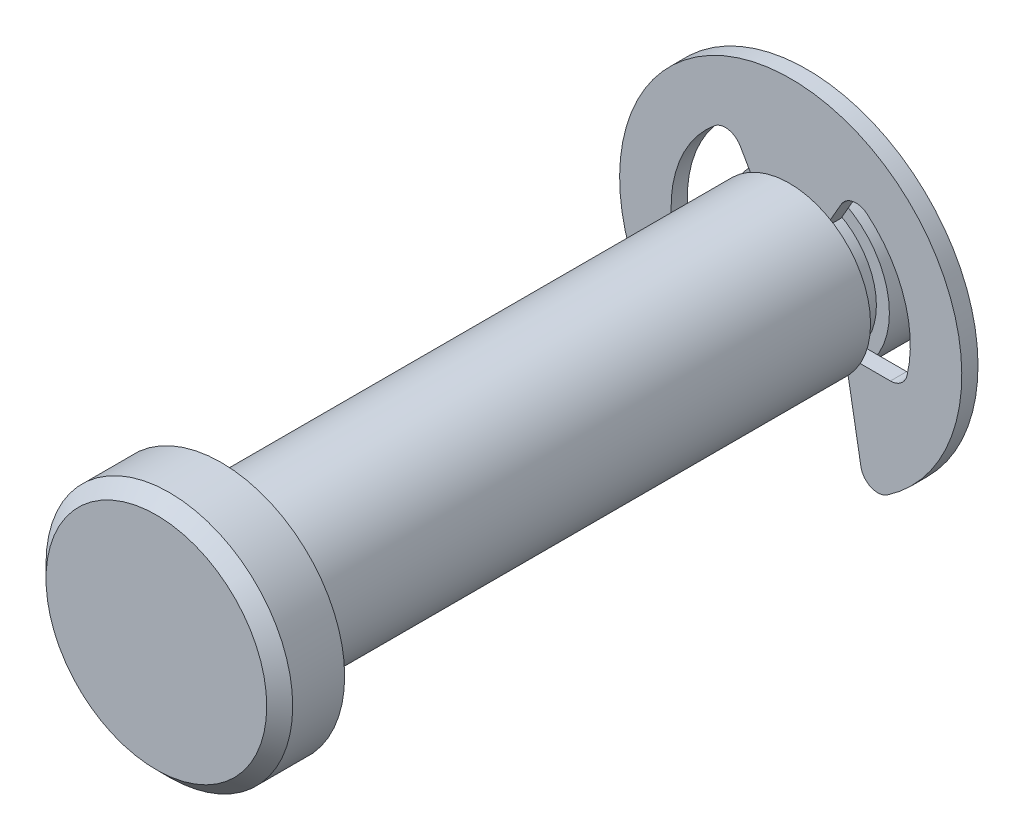
ISO-10303-21;
HEADER;
FILE_DESCRIPTION(('STEP AP214'),'2;1');
FILE_NAME('part.step','',(''),(''),'','','');
FILE_SCHEMA(('AUTOMOTIVE_DESIGN { 1 0 10303 214 1 1 1 1 }'));
ENDSEC;
DATA;
#1=APPLICATION_CONTEXT('core data for automotive mechanical design processes');
#2=APPLICATION_PROTOCOL_DEFINITION('international standard','automotive_design',2000,#1);
#3=PRODUCT_CONTEXT('',#1,'mechanical');
#4=PRODUCT('Part','Part','',(#3));
#5=PRODUCT_RELATED_PRODUCT_CATEGORY('part','',(#4));
#6=PRODUCT_DEFINITION_FORMATION('','',#4);
#7=PRODUCT_DEFINITION_CONTEXT('part definition',#1,'design');
#8=PRODUCT_DEFINITION('design','',#6,#7);
#9=PRODUCT_DEFINITION_SHAPE('','',#8);
#10=(LENGTH_UNIT() NAMED_UNIT(*) SI_UNIT(.MILLI.,.METRE.));
#11=(NAMED_UNIT(*) PLANE_ANGLE_UNIT() SI_UNIT($,.RADIAN.));
#12=(NAMED_UNIT(*) SI_UNIT($,.STERADIAN.) SOLID_ANGLE_UNIT());
#13=UNCERTAINTY_MEASURE_WITH_UNIT(LENGTH_MEASURE(1.E-05),#10,'distance_accuracy_value','');
#14=(GEOMETRIC_REPRESENTATION_CONTEXT(3) GLOBAL_UNCERTAINTY_ASSIGNED_CONTEXT((#13)) GLOBAL_UNIT_ASSIGNED_CONTEXT((#10,
#11,#12)) REPRESENTATION_CONTEXT('',''));
#15=CARTESIAN_POINT('',(0.,0.,0.));
#16=DIRECTION('',(0.,0.,1.));
#17=DIRECTION('',(1.,0.,0.));
#18=AXIS2_PLACEMENT_3D('',#15,#16,#17);
#19=CARTESIAN_POINT('',(0.,0.,-9.5758));
#20=DIRECTION('',(0.,0.,1.));
#21=DIRECTION('',(1.,0.,0.));
#22=AXIS2_PLACEMENT_3D('',#19,#20,#21);
#23=PLANE('',#22);
#24=DIRECTION('',(-0.173648177666931,0.984807753012208,0.));
#25=VECTOR('',#24,1.);
#26=CARTESIAN_POINT('',(1.79561377117954,0.316615154790629,-9.5758));
#27=LINE('',#26,#25);
#28=CARTESIAN_POINT('',(2.74784570227755,-5.08376048410501,-9.5758));
#29=VERTEX_POINT('',#28);
#30=CARTESIAN_POINT('',(2.1336,-1.6002,-9.5758));
#31=VERTEX_POINT('',#30);
#32=EDGE_CURVE('E201',#29,#31,#27,.T.);
#33=ORIENTED_EDGE('',*,*,#32,.F.);
#34=CARTESIAN_POINT('',(3.4069676832911,-4.96753949527431,-9.5758));
#35=DIRECTION('',(0.,0.,1.));
#36=DIRECTION('',(1.,0.,0.));
#37=AXIS2_PLACEMENT_3D('',#34,#35,#36);
#38=CIRCLE('',#37,0.66929);
#39=CARTESIAN_POINT('',(3.78551964810122,-5.51948832808256,-9.5758));
#40=VERTEX_POINT('',#39);
#41=EDGE_CURVE('E255',#29,#40,#38,.T.);
#42=ORIENTED_EDGE('',*,*,#41,.T.);
#43=CARTESIAN_POINT('',(0.,0.,-9.5758));
#44=DIRECTION('',(0.,0.,1.));
#45=DIRECTION('',(1.,0.,0.));
#46=AXIS2_PLACEMENT_3D('',#43,#44,#45);
#47=CIRCLE('',#46,6.6929);
#48=CARTESIAN_POINT('',(-3.78551964810122,-5.51948832808256,-9.5758));
#49=VERTEX_POINT('',#48);
#50=EDGE_CURVE('E181',#40,#49,#47,.T.);
#51=ORIENTED_EDGE('',*,*,#50,.T.);
#52=CARTESIAN_POINT('',(-3.4069676832911,-4.96753949527431,-9.5758));
#53=DIRECTION('',(0.,0.,1.));
#54=DIRECTION('',(1.,0.,0.));
#55=AXIS2_PLACEMENT_3D('',#52,#53,#54);
#56=CIRCLE('',#55,0.66929);
#57=CARTESIAN_POINT('',(-2.74784570227755,-5.08376048410501,-9.5758));
#58=VERTEX_POINT('',#57);
#59=EDGE_CURVE('E253',#49,#58,#56,.T.);
#60=ORIENTED_EDGE('',*,*,#59,.T.);
#61=DIRECTION('',(-0.173648177666931,-0.984807753012208,0.));
#62=VECTOR('',#61,1.);
#63=CARTESIAN_POINT('',(-1.79561377117954,0.316615154790629,-9.5758));
#64=LINE('',#63,#62);
#65=CARTESIAN_POINT('',(-2.1336,-1.6002,-9.5758));
#66=VERTEX_POINT('',#65);
#67=EDGE_CURVE('E197',#66,#58,#64,.T.);
#68=ORIENTED_EDGE('',*,*,#67,.F.);
#69=DIRECTION('',(1.,0.,0.));
#70=VECTOR('',#69,1.);
#71=CARTESIAN_POINT('',(0.,-1.6002,-9.5758));
#72=LINE('',#71,#70);
#73=CARTESIAN_POINT('',(-3.90112806858478,-1.6002,-9.5758));
#74=VERTEX_POINT('',#73);
#75=EDGE_CURVE('E188',#74,#66,#72,.T.);
#76=ORIENTED_EDGE('',*,*,#75,.F.);
#77=CARTESIAN_POINT('',(-3.90112806858478,-0.93091,-9.5758));
#78=DIRECTION('',(0.,0.,1.));
#79=DIRECTION('',(1.,0.,0.));
#80=AXIS2_PLACEMENT_3D('',#77,#78,#79);
#81=CIRCLE('',#80,0.66929);
#82=CARTESIAN_POINT('',(-4.55213962404525,-1.08625818556048,-9.5758));
#83=VERTEX_POINT('',#82);
#84=EDGE_CURVE('E53',#74,#83,#81,.F.);
#85=ORIENTED_EDGE('',*,*,#84,.T.);
#86=CARTESIAN_POINT('',(0.,0.,-9.5758));
#87=DIRECTION('',(0.,0.,1.));
#88=DIRECTION('',(1.,0.,0.));
#89=AXIS2_PLACEMENT_3D('',#86,#87,#88);
#90=CIRCLE('',#89,4.67995);
#91=CARTESIAN_POINT('',(-2.98351110662977,3.60563357527034,-9.5758));
#92=VERTEX_POINT('',#91);
#93=EDGE_CURVE('E213',#92,#83,#90,.T.);
#94=ORIENTED_EDGE('',*,*,#93,.F.);
#95=CARTESIAN_POINT('',(-2.55683258473184,3.08998394320319,-9.5758));
#96=DIRECTION('',(0.,0.,1.));
#97=DIRECTION('',(1.,0.,0.));
#98=AXIS2_PLACEMENT_3D('',#95,#96,#97);
#99=CIRCLE('',#98,0.66929);
#100=CARTESIAN_POINT('',(-1.97721044223295,3.42462894320319,-9.5758));
#101=VERTEX_POINT('',#100);
#102=EDGE_CURVE('E185',#92,#101,#99,.F.);
#103=ORIENTED_EDGE('',*,*,#102,.T.);
#104=DIRECTION('',(-0.500000000000001,0.866025403784438,0.));
#105=VECTOR('',#104,1.);
#106=CARTESIAN_POINT('',(0.,0.,-9.5758));
#107=LINE('',#106,#105);
#108=CARTESIAN_POINT('',(-1.3335,2.30968975189309,-9.5758));
#109=VERTEX_POINT('',#108);
#110=EDGE_CURVE('E177',#109,#101,#107,.T.);
#111=ORIENTED_EDGE('',*,*,#110,.F.);
#112=DIRECTION('',(1.,0.,0.));
#113=VECTOR('',#112,1.);
#114=CARTESIAN_POINT('',(-1.3335,2.30968975189309,-9.5758));
#115=LINE('',#114,#113);
#116=CARTESIAN_POINT('',(1.3335,2.30968975189309,-9.5758));
#117=VERTEX_POINT('',#116);
#118=EDGE_CURVE('E161',#109,#117,#115,.T.);
#119=ORIENTED_EDGE('',*,*,#118,.T.);
#120=DIRECTION('',(-0.500000000000001,-0.866025403784438,0.));
#121=VECTOR('',#120,1.);
#122=CARTESIAN_POINT('',(0.,0.,-9.5758));
#123=LINE('',#122,#121);
#124=CARTESIAN_POINT('',(1.97721044223295,3.42462894320319,-9.5758));
#125=VERTEX_POINT('',#124);
#126=EDGE_CURVE('E211',#125,#117,#123,.T.);
#127=ORIENTED_EDGE('',*,*,#126,.F.);
#128=CARTESIAN_POINT('',(2.55683258473184,3.08998394320319,-9.5758));
#129=DIRECTION('',(0.,0.,1.));
#130=DIRECTION('',(1.,0.,0.));
#131=AXIS2_PLACEMENT_3D('',#128,#129,#130);
#132=CIRCLE('',#131,0.66929);
#133=CARTESIAN_POINT('',(2.98351110662977,3.60563357527034,-9.5758));
#134=VERTEX_POINT('',#133);
#135=EDGE_CURVE('E270',#125,#134,#132,.F.);
#136=ORIENTED_EDGE('',*,*,#135,.T.);
#137=CARTESIAN_POINT('',(0.,0.,-9.5758));
#138=DIRECTION('',(0.,0.,1.));
#139=DIRECTION('',(1.,0.,0.));
#140=AXIS2_PLACEMENT_3D('',#137,#138,#139);
#141=CIRCLE('',#140,4.67995);
#142=CARTESIAN_POINT('',(4.55213962404525,-1.08625818556048,-9.5758));
#143=VERTEX_POINT('',#142);
#144=EDGE_CURVE('E216',#143,#134,#141,.T.);
#145=ORIENTED_EDGE('',*,*,#144,.F.);
#146=CARTESIAN_POINT('',(3.90112806858478,-0.93091,-9.5758));
#147=DIRECTION('',(0.,0.,1.));
#148=DIRECTION('',(1.,0.,0.));
#149=AXIS2_PLACEMENT_3D('',#146,#147,#148);
#150=CIRCLE('',#149,0.66929);
#151=CARTESIAN_POINT('',(3.90112806858478,-1.6002,-9.5758));
#152=VERTEX_POINT('',#151);
#153=EDGE_CURVE('E266',#143,#152,#150,.F.);
#154=ORIENTED_EDGE('',*,*,#153,.T.);
#155=DIRECTION('',(1.,0.,0.));
#156=VECTOR('',#155,1.);
#157=CARTESIAN_POINT('',(0.,-1.6002,-9.5758));
#158=LINE('',#157,#156);
#159=EDGE_CURVE('E206',#31,#152,#158,.T.);
#160=ORIENTED_EDGE('',*,*,#159,.F.);
#161=EDGE_LOOP('',(#33,#42,#51,#60,#68,#76,#85,#94,#103,#111,#119,#127,#136,#145,#154,#160));
#162=FACE_BOUND('',#161,.T.);
#163=ADVANCED_FACE('F45',(#162),#23,.T.);
#164=CARTESIAN_POINT('',(0.,0.,-10.2108));
#165=DIRECTION('',(0.,0.,1.));
#166=DIRECTION('',(1.,0.,0.));
#167=AXIS2_PLACEMENT_3D('',#164,#165,#166);
#168=PLANE('',#167);
#169=CARTESIAN_POINT('',(0.,0.,-10.2108));
#170=DIRECTION('',(0.,0.,1.));
#171=DIRECTION('',(1.,0.,0.));
#172=AXIS2_PLACEMENT_3D('',#169,#170,#171);
#173=CIRCLE('',#172,6.6929);
#174=CARTESIAN_POINT('',(3.78551964810122,-5.51948832808256,-10.2108));
#175=VERTEX_POINT('',#174);
#176=CARTESIAN_POINT('',(-3.78551964810122,-5.51948832808256,-10.2108));
#177=VERTEX_POINT('',#176);
#178=EDGE_CURVE('E219',#175,#177,#173,.T.);
#179=ORIENTED_EDGE('',*,*,#178,.F.);
#180=CARTESIAN_POINT('',(3.4069676832911,-4.96753949527431,-10.2108));
#181=DIRECTION('',(0.,0.,1.));
#182=DIRECTION('',(1.,0.,0.));
#183=AXIS2_PLACEMENT_3D('',#180,#181,#182);
#184=CIRCLE('',#183,0.66929);
#185=CARTESIAN_POINT('',(2.74784570227755,-5.08376048410501,-10.2108));
#186=VERTEX_POINT('',#185);
#187=EDGE_CURVE('E263',#175,#186,#184,.F.);
#188=ORIENTED_EDGE('',*,*,#187,.T.);
#189=DIRECTION('',(-0.173648177666931,0.984807753012208,0.));
#190=VECTOR('',#189,1.);
#191=CARTESIAN_POINT('',(1.79561377117954,0.316615154790629,-10.2108));
#192=LINE('',#191,#190);
#193=CARTESIAN_POINT('',(2.1336,-1.6002,-10.2108));
#194=VERTEX_POINT('',#193);
#195=EDGE_CURVE('E199',#186,#194,#192,.T.);
#196=ORIENTED_EDGE('',*,*,#195,.T.);
#197=DIRECTION('',(1.,0.,0.));
#198=VECTOR('',#197,1.);
#199=CARTESIAN_POINT('',(0.,-1.6002,-10.2108));
#200=LINE('',#199,#198);
#201=CARTESIAN_POINT('',(3.90112806858478,-1.6002,-10.2108));
#202=VERTEX_POINT('',#201);
#203=EDGE_CURVE('E203',#194,#202,#200,.T.);
#204=ORIENTED_EDGE('',*,*,#203,.T.);
#205=CARTESIAN_POINT('',(3.90112806858478,-0.93091,-10.2108));
#206=DIRECTION('',(0.,0.,1.));
#207=DIRECTION('',(1.,0.,0.));
#208=AXIS2_PLACEMENT_3D('',#205,#206,#207);
#209=CIRCLE('',#208,0.66929);
#210=CARTESIAN_POINT('',(4.55213962404525,-1.08625818556048,-10.2108));
#211=VERTEX_POINT('',#210);
#212=EDGE_CURVE('E268',#202,#211,#209,.T.);
#213=ORIENTED_EDGE('',*,*,#212,.T.);
#214=CARTESIAN_POINT('',(0.,0.,-10.2108));
#215=DIRECTION('',(0.,0.,1.));
#216=DIRECTION('',(1.,0.,0.));
#217=AXIS2_PLACEMENT_3D('',#214,#215,#216);
#218=CIRCLE('',#217,4.67995);
#219=CARTESIAN_POINT('',(2.98351110662977,3.60563357527034,-10.2108));
#220=VERTEX_POINT('',#219);
#221=EDGE_CURVE('E227',#211,#220,#218,.T.);
#222=ORIENTED_EDGE('',*,*,#221,.T.);
#223=CARTESIAN_POINT('',(2.55683258473184,3.08998394320319,-10.2108));
#224=DIRECTION('',(0.,0.,1.));
#225=DIRECTION('',(1.,0.,0.));
#226=AXIS2_PLACEMENT_3D('',#223,#224,#225);
#227=CIRCLE('',#226,0.66929);
#228=CARTESIAN_POINT('',(1.97721044223295,3.42462894320319,-10.2108));
#229=VERTEX_POINT('',#228);
#230=EDGE_CURVE('E272',#220,#229,#227,.T.);
#231=ORIENTED_EDGE('',*,*,#230,.T.);
#232=DIRECTION('',(-0.500000000000001,-0.866025403784438,0.));
#233=VECTOR('',#232,1.);
#234=CARTESIAN_POINT('',(0.,0.,-10.2108));
#235=LINE('',#234,#233);
#236=CARTESIAN_POINT('',(1.3335,2.30968975189309,-10.2108));
#237=VERTEX_POINT('',#236);
#238=EDGE_CURVE('E209',#229,#237,#235,.T.);
#239=ORIENTED_EDGE('',*,*,#238,.T.);
#240=DIRECTION('',(-1.,0.,0.));
#241=VECTOR('',#240,1.);
#242=CARTESIAN_POINT('',(-1.3335,2.30968975189309,-10.2108));
#243=LINE('',#242,#241);
#244=CARTESIAN_POINT('',(-1.3335,2.30968975189309,-10.2108));
#245=VERTEX_POINT('',#244);
#246=EDGE_CURVE('E172',#237,#245,#243,.T.);
#247=ORIENTED_EDGE('',*,*,#246,.T.);
#248=DIRECTION('',(-0.500000000000001,0.866025403784438,0.));
#249=VECTOR('',#248,1.);
#250=CARTESIAN_POINT('',(0.,0.,-10.2108));
#251=LINE('',#250,#249);
#252=CARTESIAN_POINT('',(-1.97721044223295,3.42462894320319,-10.2108));
#253=VERTEX_POINT('',#252);
#254=EDGE_CURVE('E180',#245,#253,#251,.T.);
#255=ORIENTED_EDGE('',*,*,#254,.T.);
#256=CARTESIAN_POINT('',(-2.55683258473184,3.08998394320319,-10.2108));
#257=DIRECTION('',(0.,0.,1.));
#258=DIRECTION('',(1.,0.,0.));
#259=AXIS2_PLACEMENT_3D('',#256,#257,#258);
#260=CIRCLE('',#259,0.66929);
#261=CARTESIAN_POINT('',(-2.98351110662977,3.60563357527034,-10.2108));
#262=VERTEX_POINT('',#261);
#263=EDGE_CURVE('E275',#253,#262,#260,.T.);
#264=ORIENTED_EDGE('',*,*,#263,.T.);
#265=CARTESIAN_POINT('',(0.,0.,-10.2108));
#266=DIRECTION('',(0.,0.,1.));
#267=DIRECTION('',(1.,0.,0.));
#268=AXIS2_PLACEMENT_3D('',#265,#266,#267);
#269=CIRCLE('',#268,4.67995);
#270=CARTESIAN_POINT('',(-4.55213962404525,-1.08625818556048,-10.2108));
#271=VERTEX_POINT('',#270);
#272=EDGE_CURVE('E224',#262,#271,#269,.T.);
#273=ORIENTED_EDGE('',*,*,#272,.T.);
#274=CARTESIAN_POINT('',(-3.90112806858478,-0.93091,-10.2108));
#275=DIRECTION('',(0.,0.,1.));
#276=DIRECTION('',(1.,0.,0.));
#277=AXIS2_PLACEMENT_3D('',#274,#275,#276);
#278=CIRCLE('',#277,0.66929);
#279=CARTESIAN_POINT('',(-3.90112806858478,-1.6002,-10.2108));
#280=VERTEX_POINT('',#279);
#281=EDGE_CURVE('E13',#271,#280,#278,.T.);
#282=ORIENTED_EDGE('',*,*,#281,.T.);
#283=DIRECTION('',(1.,0.,0.));
#284=VECTOR('',#283,1.);
#285=CARTESIAN_POINT('',(0.,-1.6002,-10.2108));
#286=LINE('',#285,#284);
#287=CARTESIAN_POINT('',(-2.1336,-1.6002,-10.2108));
#288=VERTEX_POINT('',#287);
#289=EDGE_CURVE('E186',#280,#288,#286,.T.);
#290=ORIENTED_EDGE('',*,*,#289,.T.);
#291=DIRECTION('',(-0.173648177666931,-0.984807753012208,0.));
#292=VECTOR('',#291,1.);
#293=CARTESIAN_POINT('',(-1.79561377117954,0.316615154790629,-10.2108));
#294=LINE('',#293,#292);
#295=CARTESIAN_POINT('',(-2.74784570227755,-5.08376048410501,-10.2108));
#296=VERTEX_POINT('',#295);
#297=EDGE_CURVE('E195',#288,#296,#294,.T.);
#298=ORIENTED_EDGE('',*,*,#297,.T.);
#299=CARTESIAN_POINT('',(-3.4069676832911,-4.96753949527431,-10.2108));
#300=DIRECTION('',(0.,0.,1.));
#301=DIRECTION('',(1.,0.,0.));
#302=AXIS2_PLACEMENT_3D('',#299,#300,#301);
#303=CIRCLE('',#302,0.66929);
#304=EDGE_CURVE('E67',#296,#177,#303,.F.);
#305=ORIENTED_EDGE('',*,*,#304,.T.);
#306=EDGE_LOOP('',(#179,#188,#196,#204,#213,#222,#231,#239,#247,#255,#264,#273,#282,#290,#298,#305));
#307=FACE_BOUND('',#306,.T.);
#308=ADVANCED_FACE('F288',(#307),#168,.F.);
#309=CARTESIAN_POINT('',(0.,0.,-9.5758));
#310=DIRECTION('',(0.,0.,-1.));
#311=DIRECTION('',(-1.,0.,0.));
#312=AXIS2_PLACEMENT_3D('',#309,#310,#311);
#313=CYLINDRICAL_SURFACE('',#312,6.6929);
#314=ORIENTED_EDGE('',*,*,#50,.F.);
#315=DIRECTION('',(0.,0.,-1.));
#316=VECTOR('',#315,1.);
#317=CARTESIAN_POINT('',(3.78551964810122,-5.51948832808256,-9.5758));
#318=LINE('',#317,#316);
#319=EDGE_CURVE('E260',#40,#175,#318,.T.);
#320=ORIENTED_EDGE('',*,*,#319,.T.);
#321=ORIENTED_EDGE('',*,*,#178,.T.);
#322=DIRECTION('',(0.,0.,-1.));
#323=VECTOR('',#322,1.);
#324=CARTESIAN_POINT('',(-3.78551964810122,-5.51948832808256,-9.5758));
#325=LINE('',#324,#323);
#326=EDGE_CURVE('E257',#177,#49,#325,.F.);
#327=ORIENTED_EDGE('',*,*,#326,.T.);
#328=EDGE_LOOP('',(#314,#320,#321,#327));
#329=FACE_BOUND('',#328,.T.);
#330=ADVANCED_FACE('F328',(#329),#313,.T.);
#331=CARTESIAN_POINT('',(-2.1336,-1.6002,-12.7));
#332=DIRECTION('',(-0.984807753012208,0.173648177666931,0.));
#333=DIRECTION('',(-0.173648177666931,-0.984807753012208,0.));
#334=AXIS2_PLACEMENT_3D('',#331,#332,#333);
#335=PLANE('',#334);
#336=ORIENTED_EDGE('',*,*,#67,.T.);
#337=DIRECTION('',(0.,0.,-1.));
#338=VECTOR('',#337,1.);
#339=CARTESIAN_POINT('',(-2.74784570227755,-5.08376048410501,-12.7));
#340=LINE('',#339,#338);
#341=EDGE_CURVE('E60',#58,#296,#340,.T.);
#342=ORIENTED_EDGE('',*,*,#341,.T.);
#343=ORIENTED_EDGE('',*,*,#297,.F.);
#344=DIRECTION('',(0.,0.,1.));
#345=VECTOR('',#344,1.);
#346=CARTESIAN_POINT('',(-2.1336,-1.6002,-12.7));
#347=LINE('',#346,#345);
#348=EDGE_CURVE('E293',#288,#66,#347,.T.);
#349=ORIENTED_EDGE('',*,*,#348,.T.);
#350=EDGE_LOOP('',(#336,#342,#343,#349));
#351=FACE_BOUND('',#350,.T.);
#352=ADVANCED_FACE('F333',(#351),#335,.F.);
#353=CARTESIAN_POINT('',(-2.33997500000001,4.05295558844098,-12.7));
#354=DIRECTION('',(0.866025403784438,0.500000000000001,0.));
#355=DIRECTION('',(-0.500000000000001,0.866025403784438,0.));
#356=AXIS2_PLACEMENT_3D('',#353,#354,#355);
#357=PLANE('',#356);
#358=ORIENTED_EDGE('',*,*,#110,.T.);
#359=DIRECTION('',(0.,0.,-1.));
#360=VECTOR('',#359,1.);
#361=CARTESIAN_POINT('',(-1.97721044223295,3.42462894320319,-10.2108));
#362=LINE('',#361,#360);
#363=EDGE_CURVE('E245',#101,#253,#362,.T.);
#364=ORIENTED_EDGE('',*,*,#363,.T.);
#365=ORIENTED_EDGE('',*,*,#254,.F.);
#366=DIRECTION('',(0.,0.,-1.));
#367=VECTOR('',#366,1.);
#368=CARTESIAN_POINT('',(-1.3335,2.30968975189309,-9.5758));
#369=LINE('',#368,#367);
#370=EDGE_CURVE('E165',#245,#109,#369,.F.);
#371=ORIENTED_EDGE('',*,*,#370,.T.);
#372=EDGE_LOOP('',(#358,#364,#365,#371));
#373=FACE_BOUND('',#372,.T.);
#374=ADVANCED_FACE('F176',(#373),#357,.F.);
#375=CARTESIAN_POINT('',(0.,0.,-12.7));
#376=DIRECTION('',(0.,0.,1.));
#377=DIRECTION('',(1.,0.,0.));
#378=AXIS2_PLACEMENT_3D('',#375,#376,#377);
#379=CYLINDRICAL_SURFACE('',#378,4.67995);
#380=ORIENTED_EDGE('',*,*,#272,.F.);
#381=DIRECTION('',(0.,0.,1.));
#382=VECTOR('',#381,1.);
#383=CARTESIAN_POINT('',(-2.98351110662977,3.60563357527034,-12.7));
#384=LINE('',#383,#382);
#385=EDGE_CURVE('E242',#262,#92,#384,.T.);
#386=ORIENTED_EDGE('',*,*,#385,.T.);
#387=ORIENTED_EDGE('',*,*,#93,.T.);
#388=DIRECTION('',(0.,0.,1.));
#389=VECTOR('',#388,1.);
#390=CARTESIAN_POINT('',(-4.55213962404525,-1.08625818556048,-12.7));
#391=LINE('',#390,#389);
#392=EDGE_CURVE('E240',#83,#271,#391,.F.);
#393=ORIENTED_EDGE('',*,*,#392,.T.);
#394=EDGE_LOOP('',(#380,#386,#387,#393));
#395=FACE_BOUND('',#394,.T.);
#396=ADVANCED_FACE('F283',(#395),#379,.F.);
#397=CARTESIAN_POINT('',(-4.39787357281903,-1.6002,-12.7));
#398=DIRECTION('',(0.,-1.,0.));
#399=DIRECTION('',(0.,0.,-1.));
#400=AXIS2_PLACEMENT_3D('',#397,#398,#399);
#401=PLANE('',#400);
#402=ORIENTED_EDGE('',*,*,#289,.F.);
#403=DIRECTION('',(0.,0.,-1.));
#404=VECTOR('',#403,1.);
#405=CARTESIAN_POINT('',(-3.90112806858478,-1.6002,-9.5758));
#406=LINE('',#405,#404);
#407=EDGE_CURVE('E247',#280,#74,#406,.F.);
#408=ORIENTED_EDGE('',*,*,#407,.T.);
#409=ORIENTED_EDGE('',*,*,#75,.T.);
#410=ORIENTED_EDGE('',*,*,#348,.F.);
#411=EDGE_LOOP('',(#402,#408,#409,#410));
#412=FACE_BOUND('',#411,.T.);
#413=ADVANCED_FACE('F291',(#412),#401,.F.);
#414=CARTESIAN_POINT('',(0.,0.,-12.7));
#415=DIRECTION('',(0.,0.,1.));
#416=DIRECTION('',(1.,0.,0.));
#417=AXIS2_PLACEMENT_3D('',#414,#415,#416);
#418=CYLINDRICAL_SURFACE('',#417,4.67995);
#419=ORIENTED_EDGE('',*,*,#221,.F.);
#420=DIRECTION('',(0.,0.,1.));
#421=VECTOR('',#420,1.);
#422=CARTESIAN_POINT('',(4.55213962404525,-1.08625818556048,-12.7));
#423=LINE('',#422,#421);
#424=EDGE_CURVE('E232',#211,#143,#423,.T.);
#425=ORIENTED_EDGE('',*,*,#424,.T.);
#426=ORIENTED_EDGE('',*,*,#144,.T.);
#427=DIRECTION('',(0.,0.,1.));
#428=VECTOR('',#427,1.);
#429=CARTESIAN_POINT('',(2.98351110662977,3.60563357527034,-12.7));
#430=LINE('',#429,#428);
#431=EDGE_CURVE('E230',#134,#220,#430,.F.);
#432=ORIENTED_EDGE('',*,*,#431,.T.);
#433=EDGE_LOOP('',(#419,#425,#426,#432));
#434=FACE_BOUND('',#433,.T.);
#435=ADVANCED_FACE('F307',(#434),#418,.F.);
#436=CARTESIAN_POINT('',(2.1336,-1.6002,-12.7));
#437=DIRECTION('',(0.,-1.,0.));
#438=DIRECTION('',(0.,0.,-1.));
#439=AXIS2_PLACEMENT_3D('',#436,#437,#438);
#440=PLANE('',#439);
#441=ORIENTED_EDGE('',*,*,#159,.T.);
#442=DIRECTION('',(0.,0.,-1.));
#443=VECTOR('',#442,1.);
#444=CARTESIAN_POINT('',(3.90112806858478,-1.6002,-10.2108));
#445=LINE('',#444,#443);
#446=EDGE_CURVE('E235',#152,#202,#445,.T.);
#447=ORIENTED_EDGE('',*,*,#446,.T.);
#448=ORIENTED_EDGE('',*,*,#203,.F.);
#449=DIRECTION('',(0.,0.,1.));
#450=VECTOR('',#449,1.);
#451=CARTESIAN_POINT('',(2.1336,-1.6002,-12.7));
#452=LINE('',#451,#450);
#453=EDGE_CURVE('E190',#194,#31,#452,.T.);
#454=ORIENTED_EDGE('',*,*,#453,.T.);
#455=EDGE_LOOP('',(#441,#447,#448,#454));
#456=FACE_BOUND('',#455,.T.);
#457=ADVANCED_FACE('F317',(#456),#440,.F.);
#458=CARTESIAN_POINT('',(2.1336,-1.6002,-12.7));
#459=DIRECTION('',(0.984807753012208,0.173648177666931,0.));
#460=DIRECTION('',(-0.173648177666931,0.984807753012208,0.));
#461=AXIS2_PLACEMENT_3D('',#458,#459,#460);
#462=PLANE('',#461);
#463=ORIENTED_EDGE('',*,*,#195,.F.);
#464=DIRECTION('',(0.,0.,-1.));
#465=VECTOR('',#464,1.);
#466=CARTESIAN_POINT('',(2.74784570227755,-5.08376048410501,-12.7));
#467=LINE('',#466,#465);
#468=EDGE_CURVE('E250',#186,#29,#467,.F.);
#469=ORIENTED_EDGE('',*,*,#468,.T.);
#470=ORIENTED_EDGE('',*,*,#32,.T.);
#471=ORIENTED_EDGE('',*,*,#453,.F.);
#472=EDGE_LOOP('',(#463,#469,#470,#471));
#473=FACE_BOUND('',#472,.T.);
#474=ADVANCED_FACE('F322',(#473),#462,.F.);
#475=CARTESIAN_POINT('',(0.,0.,-12.7));
#476=DIRECTION('',(-0.866025403784438,0.500000000000001,0.));
#477=DIRECTION('',(-0.500000000000001,-0.866025403784438,0.));
#478=AXIS2_PLACEMENT_3D('',#475,#476,#477);
#479=PLANE('',#478);
#480=ORIENTED_EDGE('',*,*,#238,.F.);
#481=DIRECTION('',(0.,0.,-1.));
#482=VECTOR('',#481,1.);
#483=CARTESIAN_POINT('',(1.97721044223295,3.42462894320319,-9.5758));
#484=LINE('',#483,#482);
#485=EDGE_CURVE('E237',#229,#125,#484,.F.);
#486=ORIENTED_EDGE('',*,*,#485,.T.);
#487=ORIENTED_EDGE('',*,*,#126,.T.);
#488=DIRECTION('',(0.,0.,-1.));
#489=VECTOR('',#488,1.);
#490=CARTESIAN_POINT('',(1.3335,2.30968975189309,-9.5758));
#491=LINE('',#490,#489);
#492=EDGE_CURVE('E168',#117,#237,#491,.T.);
#493=ORIENTED_EDGE('',*,*,#492,.T.);
#494=EDGE_LOOP('',(#480,#486,#487,#493));
#495=FACE_BOUND('',#494,.T.);
#496=ADVANCED_FACE('F300',(#495),#479,.F.);
#497=CARTESIAN_POINT('',(-1.3335,2.30968975189309,-12.9016287967469));
#498=DIRECTION('',(0.,-1.,0.));
#499=DIRECTION('',(0.,0.,-1.));
#500=AXIS2_PLACEMENT_3D('',#497,#498,#499);
#501=PLANE('',#500);
#502=ORIENTED_EDGE('',*,*,#246,.F.);
#503=ORIENTED_EDGE('',*,*,#492,.F.);
#504=ORIENTED_EDGE('',*,*,#118,.F.);
#505=ORIENTED_EDGE('',*,*,#370,.F.);
#506=EDGE_LOOP('',(#502,#503,#504,#505));
#507=FACE_BOUND('',#506,.T.);
#508=ADVANCED_FACE('F164',(#507),#501,.T.);
#509=CARTESIAN_POINT('',(3.90112806858478,-0.93091,-12.7));
#510=DIRECTION('',(0.,0.,1.));
#511=DIRECTION('',(1.,0.,0.));
#512=AXIS2_PLACEMENT_3D('',#509,#510,#511);
#513=CYLINDRICAL_SURFACE('',#512,0.66929);
#514=ORIENTED_EDGE('',*,*,#212,.F.);
#515=ORIENTED_EDGE('',*,*,#446,.F.);
#516=ORIENTED_EDGE('',*,*,#153,.F.);
#517=ORIENTED_EDGE('',*,*,#424,.F.);
#518=EDGE_LOOP('',(#514,#515,#516,#517));
#519=FACE_BOUND('',#518,.T.);
#520=ADVANCED_FACE('F313',(#519),#513,.F.);
#521=CARTESIAN_POINT('',(2.55683258473184,3.08998394320319,-12.7));
#522=DIRECTION('',(0.,0.,1.));
#523=DIRECTION('',(1.,0.,0.));
#524=AXIS2_PLACEMENT_3D('',#521,#522,#523);
#525=CYLINDRICAL_SURFACE('',#524,0.66929);
#526=ORIENTED_EDGE('',*,*,#230,.F.);
#527=ORIENTED_EDGE('',*,*,#431,.F.);
#528=ORIENTED_EDGE('',*,*,#135,.F.);
#529=ORIENTED_EDGE('',*,*,#485,.F.);
#530=EDGE_LOOP('',(#526,#527,#528,#529));
#531=FACE_BOUND('',#530,.T.);
#532=ADVANCED_FACE('F310',(#531),#525,.F.);
#533=CARTESIAN_POINT('',(-2.55683258473184,3.08998394320319,-12.7));
#534=DIRECTION('',(0.,0.,1.));
#535=DIRECTION('',(1.,0.,0.));
#536=AXIS2_PLACEMENT_3D('',#533,#534,#535);
#537=CYLINDRICAL_SURFACE('',#536,0.66929);
#538=ORIENTED_EDGE('',*,*,#263,.F.);
#539=ORIENTED_EDGE('',*,*,#363,.F.);
#540=ORIENTED_EDGE('',*,*,#102,.F.);
#541=ORIENTED_EDGE('',*,*,#385,.F.);
#542=EDGE_LOOP('',(#538,#539,#540,#541));
#543=FACE_BOUND('',#542,.T.);
#544=ADVANCED_FACE('F356',(#543),#537,.F.);
#545=CARTESIAN_POINT('',(-3.90112806858478,-0.93091,-12.7));
#546=DIRECTION('',(0.,0.,1.));
#547=DIRECTION('',(1.,0.,0.));
#548=AXIS2_PLACEMENT_3D('',#545,#546,#547);
#549=CYLINDRICAL_SURFACE('',#548,0.66929);
#550=ORIENTED_EDGE('',*,*,#281,.F.);
#551=ORIENTED_EDGE('',*,*,#392,.F.);
#552=ORIENTED_EDGE('',*,*,#84,.F.);
#553=ORIENTED_EDGE('',*,*,#407,.F.);
#554=EDGE_LOOP('',(#550,#551,#552,#553));
#555=FACE_BOUND('',#554,.T.);
#556=ADVANCED_FACE('F286',(#555),#549,.F.);
#557=CARTESIAN_POINT('',(3.4069676832911,-4.96753949527431,-9.5758));
#558=DIRECTION('',(0.,0.,-1.));
#559=DIRECTION('',(-1.,0.,0.));
#560=AXIS2_PLACEMENT_3D('',#557,#558,#559);
#561=CYLINDRICAL_SURFACE('',#560,0.66929);
#562=ORIENTED_EDGE('',*,*,#187,.F.);
#563=ORIENTED_EDGE('',*,*,#319,.F.);
#564=ORIENTED_EDGE('',*,*,#41,.F.);
#565=ORIENTED_EDGE('',*,*,#468,.F.);
#566=EDGE_LOOP('',(#562,#563,#564,#565));
#567=FACE_BOUND('',#566,.T.);
#568=ADVANCED_FACE('F331',(#567),#561,.T.);
#569=CARTESIAN_POINT('',(-3.4069676832911,-4.96753949527431,-9.5758));
#570=DIRECTION('',(0.,0.,-1.));
#571=DIRECTION('',(-1.,0.,0.));
#572=AXIS2_PLACEMENT_3D('',#569,#570,#571);
#573=CYLINDRICAL_SURFACE('',#572,0.66929);
#574=ORIENTED_EDGE('',*,*,#304,.F.);
#575=ORIENTED_EDGE('',*,*,#341,.F.);
#576=ORIENTED_EDGE('',*,*,#59,.F.);
#577=ORIENTED_EDGE('',*,*,#326,.F.);
#578=EDGE_LOOP('',(#574,#575,#576,#577));
#579=FACE_BOUND('',#578,.T.);
#580=ADVANCED_FACE('F47',(#579),#573,.T.);
#581=CLOSED_SHELL('',(#163,#308,#330,#352,#374,#396,#413,#435,#457,#474,#496,#508,#520,#532,
#544,#556,#568,#580));
#582=MANIFOLD_SOLID_BREP('B2',#581);
#583=CARTESIAN_POINT('',(0.,0.,12.7));
#584=DIRECTION('',(0.,0.,-1.));
#585=DIRECTION('',(-1.,0.,0.));
#586=AXIS2_PLACEMENT_3D('',#583,#584,#585);
#587=CYLINDRICAL_SURFACE('',#586,3.175);
#588=CARTESIAN_POINT('',(0.,0.,12.7));
#589=DIRECTION('',(0.,0.,1.));
#590=DIRECTION('',(1.,0.,0.));
#591=AXIS2_PLACEMENT_3D('',#588,#589,#590);
#592=CIRCLE('',#591,3.175);
#593=CARTESIAN_POINT('',(3.175,0.,12.7));
#594=VERTEX_POINT('',#593);
#595=EDGE_CURVE('E506',#594,#594,#592,.T.);
#596=ORIENTED_EDGE('',*,*,#595,.F.);
#597=EDGE_LOOP('',(#596));
#598=FACE_BOUND('',#597,.T.);
#599=CARTESIAN_POINT('',(0.,0.,-9.525));
#600=DIRECTION('',(0.,0.,1.));
#601=DIRECTION('',(1.,0.,0.));
#602=AXIS2_PLACEMENT_3D('',#599,#600,#601);
#603=CIRCLE('',#602,3.175);
#604=CARTESIAN_POINT('',(3.175,0.,-9.525));
#605=VERTEX_POINT('',#604);
#606=EDGE_CURVE('E518',#605,#605,#603,.T.);
#607=ORIENTED_EDGE('',*,*,#606,.T.);
#608=EDGE_LOOP('',(#607));
#609=FACE_BOUND('',#608,.T.);
#610=ADVANCED_FACE('F486',(#598,#609),#587,.T.);
#611=CARTESIAN_POINT('',(0.,3.175,-9.525));
#612=DIRECTION('',(0.,0.,-1.));
#613=DIRECTION('',(-1.,0.,0.));
#614=AXIS2_PLACEMENT_3D('',#611,#612,#613);
#615=PLANE('',#614);
#616=CARTESIAN_POINT('',(0.,0.,-9.525));
#617=DIRECTION('',(0.,0.,1.));
#618=DIRECTION('',(1.,0.,0.));
#619=AXIS2_PLACEMENT_3D('',#616,#617,#618);
#620=CIRCLE('',#619,2.667);
#621=CARTESIAN_POINT('',(2.667,0.,-9.525));
#622=VERTEX_POINT('',#621);
#623=EDGE_CURVE('E509',#622,#622,#620,.T.);
#624=ORIENTED_EDGE('',*,*,#623,.T.);
#625=EDGE_LOOP('',(#624));
#626=FACE_BOUND('',#625,.T.);
#627=ORIENTED_EDGE('',*,*,#606,.F.);
#628=EDGE_LOOP('',(#627));
#629=FACE_BOUND('',#628,.T.);
#630=ADVANCED_FACE('F536',(#626,#629),#615,.T.);
#631=CARTESIAN_POINT('',(0.,0.,12.7));
#632=DIRECTION('',(0.,0.,1.));
#633=DIRECTION('',(1.,0.,0.));
#634=AXIS2_PLACEMENT_3D('',#631,#632,#633);
#635=CYLINDRICAL_SURFACE('',#634,2.667);
#636=CARTESIAN_POINT('',(0.,0.,-10.2616));
#637=DIRECTION('',(0.,0.,1.));
#638=DIRECTION('',(1.,0.,0.));
#639=AXIS2_PLACEMENT_3D('',#636,#637,#638);
#640=CIRCLE('',#639,2.667);
#641=CARTESIAN_POINT('',(2.667,0.,-10.2616));
#642=VERTEX_POINT('',#641);
#643=EDGE_CURVE('E512',#642,#642,#640,.T.);
#644=ORIENTED_EDGE('',*,*,#643,.T.);
#645=EDGE_LOOP('',(#644));
#646=FACE_BOUND('',#645,.T.);
#647=ORIENTED_EDGE('',*,*,#623,.F.);
#648=EDGE_LOOP('',(#647));
#649=FACE_BOUND('',#648,.T.);
#650=ADVANCED_FACE('F541',(#646,#649),#635,.T.);
#651=CARTESIAN_POINT('',(0.,3.175,-10.2616));
#652=DIRECTION('',(0.,0.,1.));
#653=DIRECTION('',(1.,0.,0.));
#654=AXIS2_PLACEMENT_3D('',#651,#652,#653);
#655=PLANE('',#654);
#656=CARTESIAN_POINT('',(0.,0.,-10.2616));
#657=DIRECTION('',(0.,0.,1.));
#658=DIRECTION('',(1.,0.,0.));
#659=AXIS2_PLACEMENT_3D('',#656,#657,#658);
#660=CIRCLE('',#659,3.175);
#661=CARTESIAN_POINT('',(3.175,0.,-10.2616));
#662=VERTEX_POINT('',#661);
#663=EDGE_CURVE('E515',#662,#662,#660,.T.);
#664=ORIENTED_EDGE('',*,*,#663,.T.);
#665=EDGE_LOOP('',(#664));
#666=FACE_BOUND('',#665,.T.);
#667=ORIENTED_EDGE('',*,*,#643,.F.);
#668=EDGE_LOOP('',(#667));
#669=FACE_BOUND('',#668,.T.);
#670=ADVANCED_FACE('F547',(#666,#669),#655,.T.);
#671=CARTESIAN_POINT('',(0.,0.,-12.7));
#672=DIRECTION('',(0.,0.,1.));
#673=DIRECTION('',(1.,0.,0.));
#674=AXIS2_PLACEMENT_3D('',#671,#672,#673);
#675=PLANE('',#674);
#676=CARTESIAN_POINT('',(0.,0.,-12.7));
#677=DIRECTION('',(0.,0.,1.));
#678=DIRECTION('',(1.,0.,0.));
#679=AXIS2_PLACEMENT_3D('',#676,#677,#678);
#680=CIRCLE('',#679,2.54000000000001);
#681=CARTESIAN_POINT('',(2.54000000000001,0.,-12.7));
#682=VERTEX_POINT('',#681);
#683=EDGE_CURVE('E44',#682,#682,#680,.F.);
#684=ORIENTED_EDGE('',*,*,#683,.T.);
#685=EDGE_LOOP('',(#684));
#686=FACE_BOUND('',#685,.T.);
#687=ADVANCED_FACE('F552',(#686),#675,.F.);
#688=CARTESIAN_POINT('',(0.,0.,-12.065));
#689=DIRECTION('',(0.,0.,1.));
#690=DIRECTION('',(1.,0.,0.));
#691=AXIS2_PLACEMENT_3D('',#688,#689,#690);
#692=CIRCLE('',#691,3.175);
#693=CARTESIAN_POINT('',(3.175,0.,-12.065));
#694=VERTEX_POINT('',#693);
#695=EDGE_CURVE('E493',#694,#694,#692,.T.);
#696=ORIENTED_EDGE('',*,*,#695,.T.);
#697=EDGE_LOOP('',(#696));
#698=FACE_BOUND('',#697,.T.);
#699=ORIENTED_EDGE('',*,*,#663,.F.);
#700=EDGE_LOOP('',(#699));
#701=FACE_BOUND('',#700,.T.);
#702=ADVANCED_FACE('F530',(#698,#701),#587,.T.);
#703=CARTESIAN_POINT('',(0.,0.,12.7));
#704=DIRECTION('',(0.,0.,1.));
#705=DIRECTION('',(1.,0.,0.));
#706=AXIS2_PLACEMENT_3D('',#703,#704,#705);
#707=PLANE('',#706);
#708=CARTESIAN_POINT('',(0.,0.,12.7));
#709=DIRECTION('',(0.,0.,1.));
#710=DIRECTION('',(1.,0.,0.));
#711=AXIS2_PLACEMENT_3D('',#708,#709,#710);
#712=CIRCLE('',#711,4.826);
#713=CARTESIAN_POINT('',(4.826,0.,12.7));
#714=VERTEX_POINT('',#713);
#715=EDGE_CURVE('E521',#714,#714,#712,.T.);
#716=ORIENTED_EDGE('',*,*,#715,.F.);
#717=EDGE_LOOP('',(#716));
#718=FACE_BOUND('',#717,.T.);
#719=ORIENTED_EDGE('',*,*,#595,.T.);
#720=EDGE_LOOP('',(#719));
#721=FACE_BOUND('',#720,.T.);
#722=ADVANCED_FACE('F527',(#718,#721),#707,.F.);
#723=CARTESIAN_POINT('',(0.,0.,15.24));
#724=DIRECTION('',(0.,0.,-1.));
#725=DIRECTION('',(-1.,0.,0.));
#726=AXIS2_PLACEMENT_3D('',#723,#724,#725);
#727=CYLINDRICAL_SURFACE('',#726,4.826);
#728=CARTESIAN_POINT('',(0.,0.,14.732));
#729=DIRECTION('',(0.,0.,1.));
#730=DIRECTION('',(1.,0.,0.));
#731=AXIS2_PLACEMENT_3D('',#728,#729,#730);
#732=CIRCLE('',#731,4.826);
#733=CARTESIAN_POINT('',(4.826,0.,14.732));
#734=VERTEX_POINT('',#733);
#735=EDGE_CURVE('E497',#734,#734,#732,.F.);
#736=ORIENTED_EDGE('',*,*,#735,.T.);
#737=EDGE_LOOP('',(#736));
#738=FACE_BOUND('',#737,.T.);
#739=ORIENTED_EDGE('',*,*,#715,.T.);
#740=EDGE_LOOP('',(#739));
#741=FACE_BOUND('',#740,.T.);
#742=ADVANCED_FACE('F525',(#738,#741),#727,.T.);
#743=CARTESIAN_POINT('',(0.,0.,15.24));
#744=DIRECTION('',(0.,0.,1.));
#745=DIRECTION('',(1.,0.,0.));
#746=AXIS2_PLACEMENT_3D('',#743,#744,#745);
#747=PLANE('',#746);
#748=CARTESIAN_POINT('',(0.,0.,15.24));
#749=DIRECTION('',(0.,0.,1.));
#750=DIRECTION('',(1.,0.,0.));
#751=AXIS2_PLACEMENT_3D('',#748,#749,#750);
#752=CIRCLE('',#751,4.31799999999999);
#753=CARTESIAN_POINT('',(4.31799999999999,0.,15.24));
#754=VERTEX_POINT('',#753);
#755=EDGE_CURVE('E501',#754,#754,#752,.T.);
#756=ORIENTED_EDGE('',*,*,#755,.T.);
#757=EDGE_LOOP('',(#756));
#758=FACE_BOUND('',#757,.T.);
#759=ADVANCED_FACE('F556',(#758),#747,.T.);
#760=CARTESIAN_POINT('',(0.,0.,15.24));
#761=DIRECTION('',(0.,0.,-1.));
#762=DIRECTION('',(-1.,0.,0.));
#763=AXIS2_PLACEMENT_3D('',#760,#761,#762);
#764=CONICAL_SURFACE('',#763,4.31799999999999,0.785398163397444);
#765=ORIENTED_EDGE('',*,*,#735,.F.);
#766=EDGE_LOOP('',(#765));
#767=FACE_BOUND('',#766,.T.);
#768=ORIENTED_EDGE('',*,*,#755,.F.);
#769=EDGE_LOOP('',(#768));
#770=FACE_BOUND('',#769,.T.);
#771=ADVANCED_FACE('F554',(#767,#770),#764,.T.);
#772=CARTESIAN_POINT('',(0.,0.,-12.065));
#773=DIRECTION('',(0.,0.,1.));
#774=DIRECTION('',(1.,0.,0.));
#775=AXIS2_PLACEMENT_3D('',#772,#773,#774);
#776=CONICAL_SURFACE('',#775,3.175,0.785398163397447);
#777=ORIENTED_EDGE('',*,*,#683,.F.);
#778=EDGE_LOOP('',(#777));
#779=FACE_BOUND('',#778,.T.);
#780=ORIENTED_EDGE('',*,*,#695,.F.);
#781=EDGE_LOOP('',(#780));
#782=FACE_BOUND('',#781,.T.);
#783=ADVANCED_FACE('F488',(#779,#782),#776,.T.);
#784=CLOSED_SHELL('',(#610,#630,#650,#670,#687,#702,#722,#742,#759,#771,#783));
#785=MANIFOLD_SOLID_BREP('B7',#784);
#786=ADVANCED_BREP_SHAPE_REPRESENTATION('',(#18,#582,#785),#14);
#787=SHAPE_DEFINITION_REPRESENTATION(#9,#786);
ENDSEC;
END-ISO-10303-21;
